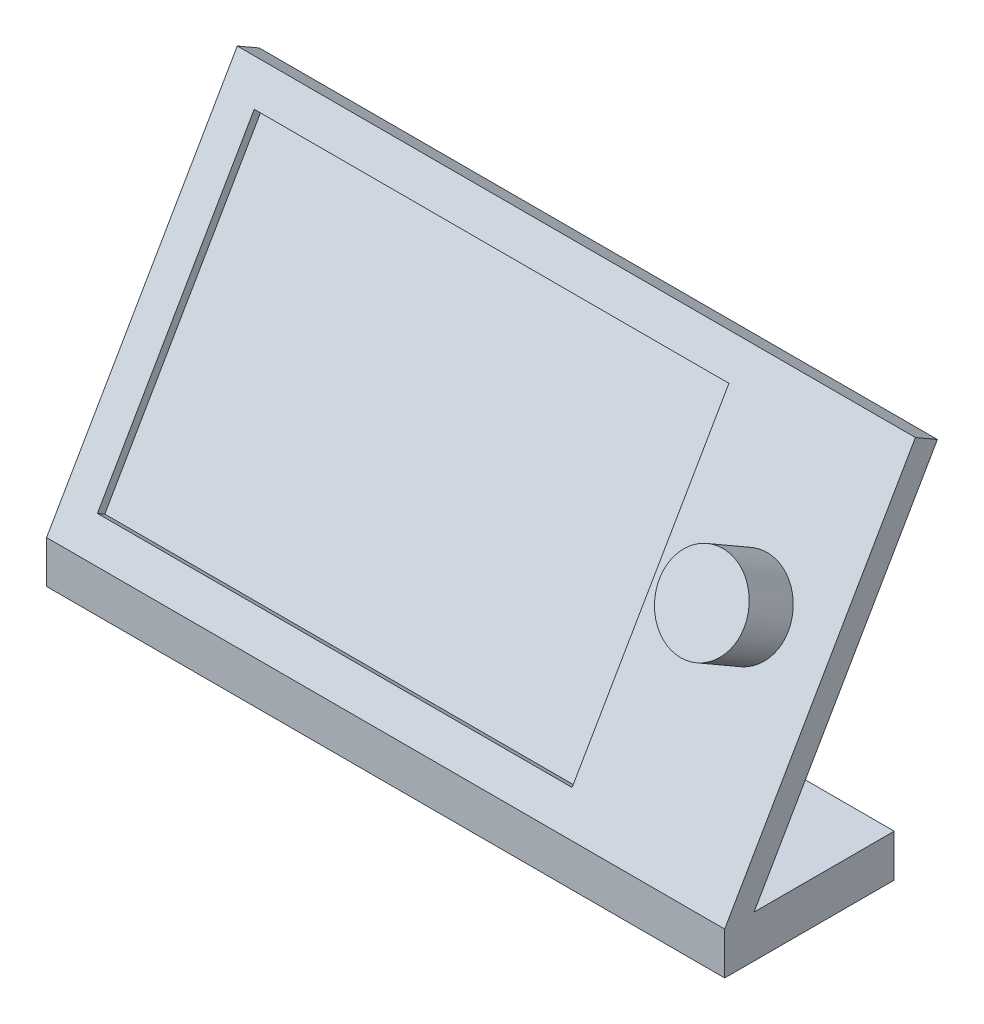
ISO-10303-21;
HEADER;
FILE_DESCRIPTION(('STEP AP214'),'2;1');
FILE_NAME('part.step','',(''),(''),'','','');
FILE_SCHEMA(('AUTOMOTIVE_DESIGN { 1 0 10303 214 1 1 1 1 }'));
ENDSEC;
DATA;
#1=APPLICATION_CONTEXT('core data for automotive mechanical design processes');
#2=APPLICATION_PROTOCOL_DEFINITION('international standard','automotive_design',2000,#1);
#3=PRODUCT_CONTEXT('',#1,'mechanical');
#4=PRODUCT('Part','Part','',(#3));
#5=PRODUCT_RELATED_PRODUCT_CATEGORY('part','',(#4));
#6=PRODUCT_DEFINITION_FORMATION('','',#4);
#7=PRODUCT_DEFINITION_CONTEXT('part definition',#1,'design');
#8=PRODUCT_DEFINITION('design','',#6,#7);
#9=PRODUCT_DEFINITION_SHAPE('','',#8);
#10=(LENGTH_UNIT() NAMED_UNIT(*) SI_UNIT(.MILLI.,.METRE.));
#11=(NAMED_UNIT(*) PLANE_ANGLE_UNIT() SI_UNIT($,.RADIAN.));
#12=(NAMED_UNIT(*) SI_UNIT($,.STERADIAN.) SOLID_ANGLE_UNIT());
#13=UNCERTAINTY_MEASURE_WITH_UNIT(LENGTH_MEASURE(1.E-05),#10,'distance_accuracy_value','');
#14=(GEOMETRIC_REPRESENTATION_CONTEXT(3) GLOBAL_UNCERTAINTY_ASSIGNED_CONTEXT((#13)) GLOBAL_UNIT_ASSIGNED_CONTEXT((#10,
#11,#12)) REPRESENTATION_CONTEXT('',''));
#15=CARTESIAN_POINT('',(0.,0.,0.));
#16=DIRECTION('',(0.,0.,1.));
#17=DIRECTION('',(1.,0.,0.));
#18=AXIS2_PLACEMENT_3D('',#15,#16,#17);
#19=CARTESIAN_POINT('',(0.,0.,25.4));
#20=DIRECTION('',(-1.,0.,0.));
#21=DIRECTION('',(0.,0.,1.));
#22=AXIS2_PLACEMENT_3D('',#19,#20,#21);
#23=PLANE('',#22);
#24=DIRECTION('',(0.,1.,0.));
#25=VECTOR('',#24,1.);
#26=CARTESIAN_POINT('',(0.,0.,0.));
#27=LINE('',#26,#25);
#28=CARTESIAN_POINT('',(0.,0.,0.));
#29=VERTEX_POINT('',#28);
#30=CARTESIAN_POINT('',(0.,6.35,0.));
#31=VERTEX_POINT('',#30);
#32=EDGE_CURVE('E204',#29,#31,#27,.T.);
#33=ORIENTED_EDGE('',*,*,#32,.T.);
#34=DIRECTION('',(0.,0.,-1.));
#35=VECTOR('',#34,1.);
#36=CARTESIAN_POINT('',(0.,6.35,25.4));
#37=LINE('',#36,#35);
#38=CARTESIAN_POINT('',(0.,6.35,21.0005909487751));
#39=VERTEX_POINT('',#38);
#40=EDGE_CURVE('E11',#39,#31,#37,.T.);
#41=ORIENTED_EDGE('',*,*,#40,.F.);
#42=DIRECTION('',(0.,0.86602540378444,-0.499999999999998));
#43=VECTOR('',#42,1.);
#44=CARTESIAN_POINT('',(0.,53.9383518262808,-6.47455678841859));
#45=LINE('',#44,#43);
#46=CARTESIAN_POINT('',(0.,53.9383518262808,-6.47455678841859));
#47=VERTEX_POINT('',#46);
#48=EDGE_CURVE('E62',#39,#47,#45,.T.);
#49=ORIENTED_EDGE('',*,*,#48,.T.);
#50=DIRECTION('',(0.,0.499999999999998,0.86602540378444));
#51=VECTOR('',#50,1.);
#52=CARTESIAN_POINT('',(0.,55.8433518262808,-3.17499999999987));
#53=LINE('',#52,#51);
#54=CARTESIAN_POINT('',(0.,55.8433518262808,-3.17499999999987));
#55=VERTEX_POINT('',#54);
#56=EDGE_CURVE('E186',#47,#55,#53,.T.);
#57=ORIENTED_EDGE('',*,*,#56,.T.);
#58=DIRECTION('',(0.,-0.86602540378444,0.499999999999998));
#59=VECTOR('',#58,1.);
#60=CARTESIAN_POINT('',(0.,6.35,25.4));
#61=LINE('',#60,#59);
#62=CARTESIAN_POINT('',(0.,6.35,25.4));
#63=VERTEX_POINT('',#62);
#64=EDGE_CURVE('E190',#55,#63,#61,.T.);
#65=ORIENTED_EDGE('',*,*,#64,.T.);
#66=DIRECTION('',(0.,1.,0.));
#67=VECTOR('',#66,1.);
#68=CARTESIAN_POINT('',(0.,0.,25.4));
#69=LINE('',#68,#67);
#70=CARTESIAN_POINT('',(0.,0.,25.4));
#71=VERTEX_POINT('',#70);
#72=EDGE_CURVE('E205',#71,#63,#69,.T.);
#73=ORIENTED_EDGE('',*,*,#72,.F.);
#74=DIRECTION('',(0.,0.,-1.));
#75=VECTOR('',#74,1.);
#76=CARTESIAN_POINT('',(0.,0.,25.4));
#77=LINE('',#76,#75);
#78=EDGE_CURVE('E220',#71,#29,#77,.T.);
#79=ORIENTED_EDGE('',*,*,#78,.T.);
#80=EDGE_LOOP('',(#33,#41,#49,#57,#65,#73,#79));
#81=FACE_BOUND('',#80,.T.);
#82=ADVANCED_FACE('F39',(#81),#23,.F.);
#83=CARTESIAN_POINT('',(0.,6.35,25.4));
#84=DIRECTION('',(0.,-1.,0.));
#85=DIRECTION('',(1.,0.,0.));
#86=AXIS2_PLACEMENT_3D('',#83,#84,#85);
#87=PLANE('',#86);
#88=DIRECTION('',(0.,0.,-1.));
#89=VECTOR('',#88,1.);
#90=CARTESIAN_POINT('',(-101.6,6.34999999999999,25.4));
#91=LINE('',#90,#89);
#92=CARTESIAN_POINT('',(-101.6,6.35,21.0005909487751));
#93=VERTEX_POINT('',#92);
#94=CARTESIAN_POINT('',(-101.6,6.34999999999999,0.));
#95=VERTEX_POINT('',#94);
#96=EDGE_CURVE('E47',#93,#95,#91,.T.);
#97=ORIENTED_EDGE('',*,*,#96,.F.);
#98=DIRECTION('',(1.,0.,0.));
#99=VECTOR('',#98,1.);
#100=CARTESIAN_POINT('',(-160.469170585784,6.35,21.0005909487751));
#101=LINE('',#100,#99);
#102=EDGE_CURVE('E194',#93,#39,#101,.T.);
#103=ORIENTED_EDGE('',*,*,#102,.T.);
#104=ORIENTED_EDGE('',*,*,#40,.T.);
#105=DIRECTION('',(-1.,0.,0.));
#106=VECTOR('',#105,1.);
#107=CARTESIAN_POINT('',(0.,6.35,0.));
#108=LINE('',#107,#106);
#109=EDGE_CURVE('E224',#31,#95,#108,.T.);
#110=ORIENTED_EDGE('',*,*,#109,.T.);
#111=EDGE_LOOP('',(#97,#103,#104,#110));
#112=FACE_BOUND('',#111,.T.);
#113=ADVANCED_FACE('F248',(#112),#87,.F.);
#114=CARTESIAN_POINT('',(-101.6,0.,25.4));
#115=DIRECTION('',(1.,0.,0.));
#116=DIRECTION('',(0.,0.,-1.));
#117=AXIS2_PLACEMENT_3D('',#114,#115,#116);
#118=PLANE('',#117);
#119=DIRECTION('',(0.,-1.,0.));
#120=VECTOR('',#119,1.);
#121=CARTESIAN_POINT('',(-101.6,0.,0.));
#122=LINE('',#121,#120);
#123=CARTESIAN_POINT('',(-101.6,0.,0.));
#124=VERTEX_POINT('',#123);
#125=EDGE_CURVE('E228',#95,#124,#122,.T.);
#126=ORIENTED_EDGE('',*,*,#125,.T.);
#127=DIRECTION('',(0.,0.,-1.));
#128=VECTOR('',#127,1.);
#129=CARTESIAN_POINT('',(-101.6,0.,25.4));
#130=LINE('',#129,#128);
#131=CARTESIAN_POINT('',(-101.6,0.,25.4));
#132=VERTEX_POINT('',#131);
#133=EDGE_CURVE('E236',#132,#124,#130,.T.);
#134=ORIENTED_EDGE('',*,*,#133,.F.);
#135=DIRECTION('',(0.,-1.,0.));
#136=VECTOR('',#135,1.);
#137=CARTESIAN_POINT('',(-101.6,0.,25.4));
#138=LINE('',#137,#136);
#139=CARTESIAN_POINT('',(-101.6,6.35,25.4));
#140=VERTEX_POINT('',#139);
#141=EDGE_CURVE('E214',#140,#132,#138,.T.);
#142=ORIENTED_EDGE('',*,*,#141,.F.);
#143=DIRECTION('',(0.,0.86602540378444,-0.499999999999998));
#144=VECTOR('',#143,1.);
#145=CARTESIAN_POINT('',(-101.6,6.35,25.4));
#146=LINE('',#145,#144);
#147=CARTESIAN_POINT('',(-101.6,55.8433518262808,-3.17499999999987));
#148=VERTEX_POINT('',#147);
#149=EDGE_CURVE('E179',#140,#148,#146,.T.);
#150=ORIENTED_EDGE('',*,*,#149,.T.);
#151=DIRECTION('',(0.,-0.499999999999998,-0.86602540378444));
#152=VECTOR('',#151,1.);
#153=CARTESIAN_POINT('',(-101.6,55.8433518262808,-3.17499999999987));
#154=LINE('',#153,#152);
#155=CARTESIAN_POINT('',(-101.6,53.9383518262808,-6.47455678841859));
#156=VERTEX_POINT('',#155);
#157=EDGE_CURVE('E176',#148,#156,#154,.T.);
#158=ORIENTED_EDGE('',*,*,#157,.T.);
#159=DIRECTION('',(0.,-0.86602540378444,0.499999999999998));
#160=VECTOR('',#159,1.);
#161=CARTESIAN_POINT('',(-101.6,53.9383518262808,-6.47455678841859));
#162=LINE('',#161,#160);
#163=EDGE_CURVE('E183',#156,#93,#162,.T.);
#164=ORIENTED_EDGE('',*,*,#163,.T.);
#165=ORIENTED_EDGE('',*,*,#96,.T.);
#166=EDGE_LOOP('',(#126,#134,#142,#150,#158,#164,#165));
#167=FACE_BOUND('',#166,.T.);
#168=ADVANCED_FACE('F242',(#167),#118,.F.);
#169=CARTESIAN_POINT('',(0.,0.,25.4));
#170=DIRECTION('',(0.,1.,0.));
#171=DIRECTION('',(-1.,0.,0.));
#172=AXIS2_PLACEMENT_3D('',#169,#170,#171);
#173=PLANE('',#172);
#174=DIRECTION('',(1.,0.,0.));
#175=VECTOR('',#174,1.);
#176=CARTESIAN_POINT('',(0.,0.,0.));
#177=LINE('',#176,#175);
#178=EDGE_CURVE('E210',#124,#29,#177,.T.);
#179=ORIENTED_EDGE('',*,*,#178,.T.);
#180=ORIENTED_EDGE('',*,*,#78,.F.);
#181=DIRECTION('',(1.,0.,0.));
#182=VECTOR('',#181,1.);
#183=CARTESIAN_POINT('',(0.,0.,25.4));
#184=LINE('',#183,#182);
#185=EDGE_CURVE('E217',#132,#71,#184,.T.);
#186=ORIENTED_EDGE('',*,*,#185,.F.);
#187=ORIENTED_EDGE('',*,*,#133,.T.);
#188=EDGE_LOOP('',(#179,#180,#186,#187));
#189=FACE_BOUND('',#188,.T.);
#190=ADVANCED_FACE('F256',(#189),#173,.F.);
#191=CARTESIAN_POINT('',(0.,0.,25.4));
#192=DIRECTION('',(0.,0.,1.));
#193=DIRECTION('',(1.,0.,0.));
#194=AXIS2_PLACEMENT_3D('',#191,#192,#193);
#195=PLANE('',#194);
#196=ORIENTED_EDGE('',*,*,#72,.T.);
#197=DIRECTION('',(-1.,0.,0.));
#198=VECTOR('',#197,1.);
#199=CARTESIAN_POINT('',(0.,6.35,25.4));
#200=LINE('',#199,#198);
#201=EDGE_CURVE('E209',#63,#140,#200,.T.);
#202=ORIENTED_EDGE('',*,*,#201,.T.);
#203=ORIENTED_EDGE('',*,*,#141,.T.);
#204=ORIENTED_EDGE('',*,*,#185,.T.);
#205=EDGE_LOOP('',(#196,#202,#203,#204));
#206=FACE_BOUND('',#205,.T.);
#207=ADVANCED_FACE('F262',(#206),#195,.T.);
#208=CARTESIAN_POINT('',(0.,0.,0.));
#209=DIRECTION('',(0.,0.,1.));
#210=DIRECTION('',(1.,0.,0.));
#211=AXIS2_PLACEMENT_3D('',#208,#209,#210);
#212=PLANE('',#211);
#213=ORIENTED_EDGE('',*,*,#32,.F.);
#214=ORIENTED_EDGE('',*,*,#178,.F.);
#215=ORIENTED_EDGE('',*,*,#125,.F.);
#216=ORIENTED_EDGE('',*,*,#109,.F.);
#217=EDGE_LOOP('',(#213,#214,#215,#216));
#218=FACE_BOUND('',#217,.T.);
#219=ADVANCED_FACE('F253',(#218),#212,.F.);
#220=CARTESIAN_POINT('',(-160.469170585784,6.35,25.4));
#221=DIRECTION('',(0.,0.499999999999998,0.86602540378444));
#222=DIRECTION('',(0.,-0.86602540378444,0.499999999999998));
#223=AXIS2_PLACEMENT_3D('',#220,#221,#222);
#224=PLANE('',#223);
#225=CARTESIAN_POINT('',(-12.7,33.846306570156,9.52500000000007));
#226=DIRECTION('',(0.,0.499999999999998,0.86602540378444));
#227=DIRECTION('',(0.,-0.86602540378444,0.499999999999998));
#228=AXIS2_PLACEMENT_3D('',#225,#226,#227);
#229=CIRCLE('',#228,6.35);
#230=CARTESIAN_POINT('',(-12.7,28.3470452561248,12.7000000000001));
#231=VERTEX_POINT('',#230);
#232=EDGE_CURVE('E152',#231,#231,#229,.T.);
#233=ORIENTED_EDGE('',*,*,#232,.F.);
#234=EDGE_LOOP('',(#233));
#235=FACE_BOUND('',#234,.T.);
#236=DIRECTION('',(0.,-0.86602540378444,0.499999999999998));
#237=VECTOR('',#236,1.);
#238=CARTESIAN_POINT('',(-96.52,51.4439427750558,-0.634999999999889));
#239=LINE('',#238,#237);
#240=CARTESIAN_POINT('',(-96.52,51.4439427750558,-0.634999999999889));
#241=VERTEX_POINT('',#240);
#242=CARTESIAN_POINT('',(-96.52,10.749409051225,22.86));
#243=VERTEX_POINT('',#242);
#244=EDGE_CURVE('E54',#241,#243,#239,.T.);
#245=ORIENTED_EDGE('',*,*,#244,.F.);
#246=DIRECTION('',(-1.,0.,0.));
#247=VECTOR('',#246,1.);
#248=CARTESIAN_POINT('',(-96.52,51.4439427750558,-0.634999999999889));
#249=LINE('',#248,#247);
#250=CARTESIAN_POINT('',(-25.4,51.4439427750558,-0.634999999999889));
#251=VERTEX_POINT('',#250);
#252=EDGE_CURVE('E145',#251,#241,#249,.T.);
#253=ORIENTED_EDGE('',*,*,#252,.F.);
#254=DIRECTION('',(0.,0.86602540378444,-0.499999999999998));
#255=VECTOR('',#254,1.);
#256=CARTESIAN_POINT('',(-25.4,51.4439427750558,-0.634999999999889));
#257=LINE('',#256,#255);
#258=CARTESIAN_POINT('',(-25.4,10.749409051225,22.86));
#259=VERTEX_POINT('',#258);
#260=EDGE_CURVE('E149',#259,#251,#257,.T.);
#261=ORIENTED_EDGE('',*,*,#260,.F.);
#262=DIRECTION('',(1.,0.,0.));
#263=VECTOR('',#262,1.);
#264=CARTESIAN_POINT('',(-96.52,10.749409051225,22.86));
#265=LINE('',#264,#263);
#266=EDGE_CURVE('E161',#243,#259,#265,.T.);
#267=ORIENTED_EDGE('',*,*,#266,.F.);
#268=EDGE_LOOP('',(#245,#253,#261,#267));
#269=FACE_BOUND('',#268,.T.);
#270=ORIENTED_EDGE('',*,*,#149,.F.);
#271=ORIENTED_EDGE('',*,*,#201,.F.);
#272=ORIENTED_EDGE('',*,*,#64,.F.);
#273=DIRECTION('',(1.,0.,0.));
#274=VECTOR('',#273,1.);
#275=CARTESIAN_POINT('',(-160.469170585784,55.8433518262808,-3.17499999999987));
#276=LINE('',#275,#274);
#277=EDGE_CURVE('E180',#148,#55,#276,.T.);
#278=ORIENTED_EDGE('',*,*,#277,.F.);
#279=EDGE_LOOP('',(#270,#271,#272,#278));
#280=FACE_BOUND('',#279,.T.);
#281=ADVANCED_FACE('F271',(#235,#269,#280),#224,.T.);
#282=CARTESIAN_POINT('',(-160.469170585784,55.8433518262808,-3.17499999999987));
#283=DIRECTION('',(0.,0.86602540378444,-0.499999999999998));
#284=DIRECTION('',(0.,0.499999999999998,0.86602540378444));
#285=AXIS2_PLACEMENT_3D('',#282,#283,#284);
#286=PLANE('',#285);
#287=ORIENTED_EDGE('',*,*,#157,.F.);
#288=ORIENTED_EDGE('',*,*,#277,.T.);
#289=ORIENTED_EDGE('',*,*,#56,.F.);
#290=DIRECTION('',(1.,0.,0.));
#291=VECTOR('',#290,1.);
#292=CARTESIAN_POINT('',(-160.469170585784,53.9383518262808,-6.47455678841859));
#293=LINE('',#292,#291);
#294=EDGE_CURVE('E197',#156,#47,#293,.T.);
#295=ORIENTED_EDGE('',*,*,#294,.F.);
#296=EDGE_LOOP('',(#287,#288,#289,#295));
#297=FACE_BOUND('',#296,.T.);
#298=ADVANCED_FACE('F269',(#297),#286,.T.);
#299=CARTESIAN_POINT('',(-160.469170585784,53.9383518262808,-6.47455678841859));
#300=DIRECTION('',(0.,-0.499999999999998,-0.86602540378444));
#301=DIRECTION('',(0.,0.86602540378444,-0.499999999999998));
#302=AXIS2_PLACEMENT_3D('',#299,#300,#301);
#303=PLANE('',#302);
#304=ORIENTED_EDGE('',*,*,#163,.F.);
#305=ORIENTED_EDGE('',*,*,#294,.T.);
#306=ORIENTED_EDGE('',*,*,#48,.F.);
#307=ORIENTED_EDGE('',*,*,#102,.F.);
#308=EDGE_LOOP('',(#304,#305,#306,#307));
#309=FACE_BOUND('',#308,.T.);
#310=ADVANCED_FACE('F279',(#309),#303,.T.);
#311=CARTESIAN_POINT('',(-96.52,50.8089427750558,-1.73485226280613));
#312=DIRECTION('',(-1.,0.,0.));
#313=DIRECTION('',(0.,0.,1.));
#314=AXIS2_PLACEMENT_3D('',#311,#312,#313);
#315=PLANE('',#314);
#316=ORIENTED_EDGE('',*,*,#244,.T.);
#317=DIRECTION('',(0.,0.499999999999998,0.86602540378444));
#318=VECTOR('',#317,1.);
#319=CARTESIAN_POINT('',(-96.52,10.114409051225,21.7601477371938));
#320=LINE('',#319,#318);
#321=CARTESIAN_POINT('',(-96.52,10.114409051225,21.7601477371938));
#322=VERTEX_POINT('',#321);
#323=EDGE_CURVE('E120',#322,#243,#320,.T.);
#324=ORIENTED_EDGE('',*,*,#323,.F.);
#325=DIRECTION('',(0.,-0.86602540378444,0.499999999999998));
#326=VECTOR('',#325,1.);
#327=CARTESIAN_POINT('',(-96.52,50.8089427750558,-1.73485226280613));
#328=LINE('',#327,#326);
#329=CARTESIAN_POINT('',(-96.52,50.8089427750558,-1.73485226280613));
#330=VERTEX_POINT('',#329);
#331=EDGE_CURVE('E124',#330,#322,#328,.T.);
#332=ORIENTED_EDGE('',*,*,#331,.F.);
#333=DIRECTION('',(0.,0.499999999999998,0.86602540378444));
#334=VECTOR('',#333,1.);
#335=CARTESIAN_POINT('',(-96.52,50.8089427750558,-1.73485226280613));
#336=LINE('',#335,#334);
#337=EDGE_CURVE('E168',#330,#241,#336,.T.);
#338=ORIENTED_EDGE('',*,*,#337,.T.);
#339=EDGE_LOOP('',(#316,#324,#332,#338));
#340=FACE_BOUND('',#339,.T.);
#341=ADVANCED_FACE('F122',(#340),#315,.F.);
#342=CARTESIAN_POINT('',(-96.52,50.8089427750558,-1.73485226280613));
#343=DIRECTION('',(0.,0.86602540378444,-0.499999999999998));
#344=DIRECTION('',(0.,0.499999999999998,0.86602540378444));
#345=AXIS2_PLACEMENT_3D('',#342,#343,#344);
#346=PLANE('',#345);
#347=ORIENTED_EDGE('',*,*,#252,.T.);
#348=ORIENTED_EDGE('',*,*,#337,.F.);
#349=DIRECTION('',(-1.,0.,0.));
#350=VECTOR('',#349,1.);
#351=CARTESIAN_POINT('',(-96.52,50.8089427750558,-1.73485226280613));
#352=LINE('',#351,#350);
#353=CARTESIAN_POINT('',(-25.4,50.8089427750558,-1.73485226280613));
#354=VERTEX_POINT('',#353);
#355=EDGE_CURVE('E131',#354,#330,#352,.T.);
#356=ORIENTED_EDGE('',*,*,#355,.F.);
#357=DIRECTION('',(0.,0.499999999999998,0.86602540378444));
#358=VECTOR('',#357,1.);
#359=CARTESIAN_POINT('',(-25.4,50.8089427750558,-1.73485226280613));
#360=LINE('',#359,#358);
#361=EDGE_CURVE('E171',#354,#251,#360,.T.);
#362=ORIENTED_EDGE('',*,*,#361,.T.);
#363=EDGE_LOOP('',(#347,#348,#356,#362));
#364=FACE_BOUND('',#363,.T.);
#365=ADVANCED_FACE('F302',(#364),#346,.F.);
#366=CARTESIAN_POINT('',(-25.4,50.8089427750558,-1.73485226280613));
#367=DIRECTION('',(1.,0.,0.));
#368=DIRECTION('',(0.,0.,-1.));
#369=AXIS2_PLACEMENT_3D('',#366,#367,#368);
#370=PLANE('',#369);
#371=ORIENTED_EDGE('',*,*,#260,.T.);
#372=ORIENTED_EDGE('',*,*,#361,.F.);
#373=DIRECTION('',(0.,0.86602540378444,-0.499999999999998));
#374=VECTOR('',#373,1.);
#375=CARTESIAN_POINT('',(-25.4,50.8089427750558,-1.73485226280613));
#376=LINE('',#375,#374);
#377=CARTESIAN_POINT('',(-25.4,10.114409051225,21.7601477371938));
#378=VERTEX_POINT('',#377);
#379=EDGE_CURVE('E140',#378,#354,#376,.T.);
#380=ORIENTED_EDGE('',*,*,#379,.F.);
#381=DIRECTION('',(0.,0.499999999999998,0.86602540378444));
#382=VECTOR('',#381,1.);
#383=CARTESIAN_POINT('',(-25.4,10.114409051225,21.7601477371938));
#384=LINE('',#383,#382);
#385=EDGE_CURVE('E130',#378,#259,#384,.T.);
#386=ORIENTED_EDGE('',*,*,#385,.T.);
#387=EDGE_LOOP('',(#371,#372,#380,#386));
#388=FACE_BOUND('',#387,.T.);
#389=ADVANCED_FACE('F306',(#388),#370,.F.);
#390=CARTESIAN_POINT('',(-96.52,10.114409051225,21.7601477371938));
#391=DIRECTION('',(0.,-0.86602540378444,0.499999999999998));
#392=DIRECTION('',(0.,-0.499999999999998,-0.86602540378444));
#393=AXIS2_PLACEMENT_3D('',#390,#391,#392);
#394=PLANE('',#393);
#395=ORIENTED_EDGE('',*,*,#266,.T.);
#396=ORIENTED_EDGE('',*,*,#385,.F.);
#397=DIRECTION('',(1.,0.,0.));
#398=VECTOR('',#397,1.);
#399=CARTESIAN_POINT('',(-96.52,10.114409051225,21.7601477371938));
#400=LINE('',#399,#398);
#401=EDGE_CURVE('E134',#322,#378,#400,.T.);
#402=ORIENTED_EDGE('',*,*,#401,.F.);
#403=ORIENTED_EDGE('',*,*,#323,.T.);
#404=EDGE_LOOP('',(#395,#396,#402,#403));
#405=FACE_BOUND('',#404,.T.);
#406=ADVANCED_FACE('F135',(#405),#394,.F.);
#407=CARTESIAN_POINT('',(0.,11.9510226280623,20.6997783942094));
#408=DIRECTION('',(0.,0.499999999999998,0.86602540378444));
#409=DIRECTION('',(0.,-0.86602540378444,0.499999999999998));
#410=AXIS2_PLACEMENT_3D('',#407,#408,#409);
#411=PLANE('',#410);
#412=ORIENTED_EDGE('',*,*,#331,.T.);
#413=ORIENTED_EDGE('',*,*,#401,.T.);
#414=ORIENTED_EDGE('',*,*,#379,.T.);
#415=ORIENTED_EDGE('',*,*,#355,.T.);
#416=EDGE_LOOP('',(#412,#413,#414,#415));
#417=FACE_BOUND('',#416,.T.);
#418=ADVANCED_FACE('F142',(#417),#411,.T.);
#419=CARTESIAN_POINT('',(-12.7,37.656306570156,16.1241135768375));
#420=DIRECTION('',(0.,-0.499999999999998,-0.86602540378444));
#421=DIRECTION('',(0.,0.86602540378444,-0.499999999999998));
#422=AXIS2_PLACEMENT_3D('',#419,#420,#421);
#423=CYLINDRICAL_SURFACE('',#422,6.35);
#424=CARTESIAN_POINT('',(-12.7,37.656306570156,16.1241135768375));
#425=DIRECTION('',(0.,0.499999999999998,0.86602540378444));
#426=DIRECTION('',(0.,-0.86602540378444,0.499999999999998));
#427=AXIS2_PLACEMENT_3D('',#424,#425,#426);
#428=CIRCLE('',#427,6.35);
#429=CARTESIAN_POINT('',(-12.7,32.1570452561248,19.2991135768375));
#430=VERTEX_POINT('',#429);
#431=EDGE_CURVE('E162',#430,#430,#428,.T.);
#432=ORIENTED_EDGE('',*,*,#431,.F.);
#433=EDGE_LOOP('',(#432));
#434=FACE_BOUND('',#433,.T.);
#435=ORIENTED_EDGE('',*,*,#232,.T.);
#436=EDGE_LOOP('',(#435));
#437=FACE_BOUND('',#436,.T.);
#438=ADVANCED_FACE('F317',(#434,#437),#423,.T.);
#439=CARTESIAN_POINT('',(-12.7,37.656306570156,16.1241135768375));
#440=DIRECTION('',(0.,0.499999999999998,0.86602540378444));
#441=DIRECTION('',(0.,-0.86602540378444,0.499999999999998));
#442=AXIS2_PLACEMENT_3D('',#439,#440,#441);
#443=PLANE('',#442);
#444=ORIENTED_EDGE('',*,*,#431,.T.);
#445=EDGE_LOOP('',(#444));
#446=FACE_BOUND('',#445,.T.);
#447=ADVANCED_FACE('F320',(#446),#443,.T.);
#448=CLOSED_SHELL('',(#82,#113,#168,#190,#207,#219,#281,#298,#310,#341,#365,#389,#406,#418,#438,#447));
#449=MANIFOLD_SOLID_BREP('B2',#448);
#450=ADVANCED_BREP_SHAPE_REPRESENTATION('',(#18,#449),#14);
#451=SHAPE_DEFINITION_REPRESENTATION(#9,#450);
ENDSEC;
END-ISO-10303-21;
